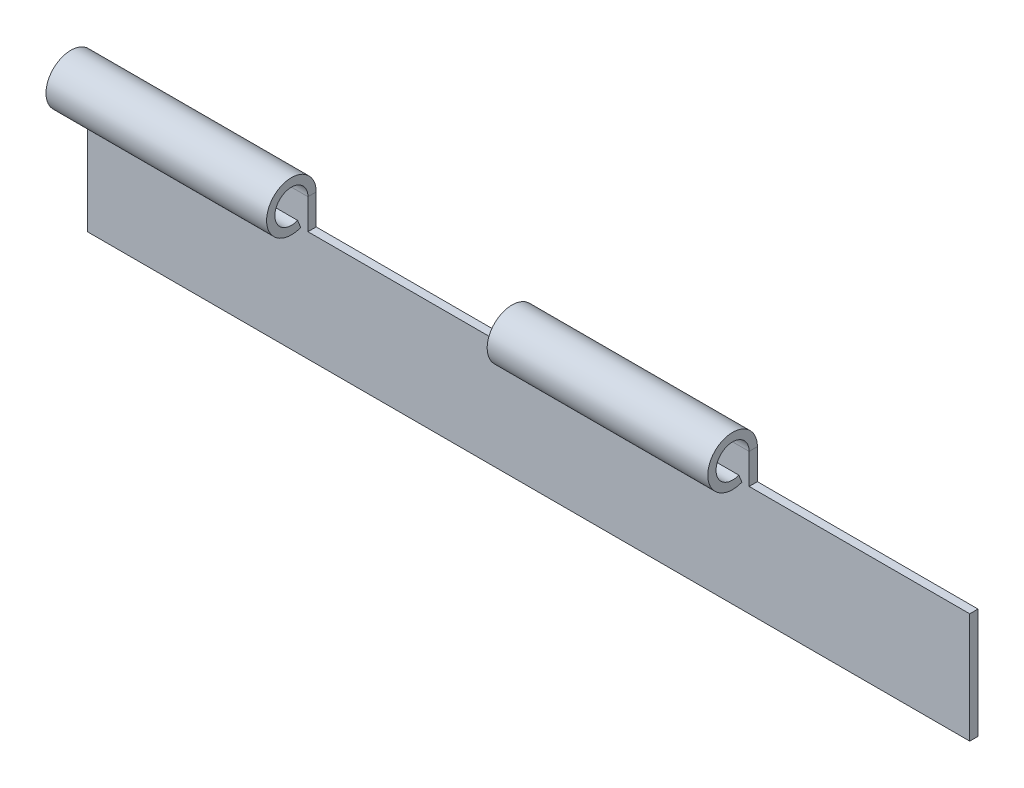
ISO-10303-21;
HEADER;
FILE_DESCRIPTION(('STEP AP214'),'2;1');
FILE_NAME('part.step','',(''),(''),'','','');
FILE_SCHEMA(('AUTOMOTIVE_DESIGN { 1 0 10303 214 1 1 1 1 }'));
ENDSEC;
DATA;
#1=APPLICATION_CONTEXT('core data for automotive mechanical design processes');
#2=APPLICATION_PROTOCOL_DEFINITION('international standard','automotive_design',2000,#1);
#3=PRODUCT_CONTEXT('',#1,'mechanical');
#4=PRODUCT('Part','Part','',(#3));
#5=PRODUCT_RELATED_PRODUCT_CATEGORY('part','',(#4));
#6=PRODUCT_DEFINITION_FORMATION('','',#4);
#7=PRODUCT_DEFINITION_CONTEXT('part definition',#1,'design');
#8=PRODUCT_DEFINITION('design','',#6,#7);
#9=PRODUCT_DEFINITION_SHAPE('','',#8);
#10=(LENGTH_UNIT() NAMED_UNIT(*) SI_UNIT(.MILLI.,.METRE.));
#11=(NAMED_UNIT(*) PLANE_ANGLE_UNIT() SI_UNIT($,.RADIAN.));
#12=(NAMED_UNIT(*) SI_UNIT($,.STERADIAN.) SOLID_ANGLE_UNIT());
#13=UNCERTAINTY_MEASURE_WITH_UNIT(LENGTH_MEASURE(1.E-05),#10,'distance_accuracy_value','');
#14=(GEOMETRIC_REPRESENTATION_CONTEXT(3) GLOBAL_UNCERTAINTY_ASSIGNED_CONTEXT((#13)) GLOBAL_UNIT_ASSIGNED_CONTEXT((#10,
#11,#12)) REPRESENTATION_CONTEXT('',''));
#15=CARTESIAN_POINT('',(0.,0.,0.));
#16=DIRECTION('',(0.,0.,1.));
#17=DIRECTION('',(1.,0.,0.));
#18=AXIS2_PLACEMENT_3D('',#15,#16,#17);
#19=CARTESIAN_POINT('',(80.,20.,-1.5));
#20=DIRECTION('',(-1.,0.,0.));
#21=DIRECTION('',(0.,0.,1.));
#22=AXIS2_PLACEMENT_3D('',#19,#20,#21);
#23=PLANE('',#22);
#24=DIRECTION('',(0.,-1.,0.));
#25=VECTOR('',#24,1.);
#26=CARTESIAN_POINT('',(80.,20.,0.));
#27=LINE('',#26,#25);
#28=CARTESIAN_POINT('',(80.,25.5,0.));
#29=VERTEX_POINT('',#28);
#30=CARTESIAN_POINT('',(80.,20.,0.));
#31=VERTEX_POINT('',#30);
#32=EDGE_CURVE('E207',#29,#31,#27,.T.);
#33=ORIENTED_EDGE('',*,*,#32,.F.);
#34=DIRECTION('',(0.,0.,-1.));
#35=VECTOR('',#34,1.);
#36=CARTESIAN_POINT('',(80.,25.5,0.));
#37=LINE('',#36,#35);
#38=CARTESIAN_POINT('',(80.,25.5,-1.5));
#39=VERTEX_POINT('',#38);
#40=EDGE_CURVE('E155',#29,#39,#37,.T.);
#41=ORIENTED_EDGE('',*,*,#40,.T.);
#42=DIRECTION('',(0.,-1.,0.));
#43=VECTOR('',#42,1.);
#44=CARTESIAN_POINT('',(80.,20.,-1.5));
#45=LINE('',#44,#43);
#46=CARTESIAN_POINT('',(80.,20.,-1.5));
#47=VERTEX_POINT('',#46);
#48=EDGE_CURVE('E175',#39,#47,#45,.T.);
#49=ORIENTED_EDGE('',*,*,#48,.T.);
#50=DIRECTION('',(0.,0.,1.));
#51=VECTOR('',#50,1.);
#52=CARTESIAN_POINT('',(80.,20.,-1.5));
#53=LINE('',#52,#51);
#54=EDGE_CURVE('E219',#47,#31,#53,.T.);
#55=ORIENTED_EDGE('',*,*,#54,.T.);
#56=EDGE_LOOP('',(#33,#41,#49,#55));
#57=FACE_BOUND('',#56,.T.);
#58=ADVANCED_FACE('F38',(#57),#23,.T.);
#59=CARTESIAN_POINT('',(0.,0.,-1.5));
#60=DIRECTION('',(-1.,0.,0.));
#61=DIRECTION('',(0.,0.,1.));
#62=AXIS2_PLACEMENT_3D('',#59,#60,#61);
#63=PLANE('',#62);
#64=DIRECTION('',(0.,-1.,0.));
#65=VECTOR('',#64,1.);
#66=CARTESIAN_POINT('',(0.,0.,0.));
#67=LINE('',#66,#65);
#68=CARTESIAN_POINT('',(0.,25.5,0.));
#69=VERTEX_POINT('',#68);
#70=CARTESIAN_POINT('',(0.,0.,0.));
#71=VERTEX_POINT('',#70);
#72=EDGE_CURVE('E215',#69,#71,#67,.T.);
#73=ORIENTED_EDGE('',*,*,#72,.F.);
#74=DIRECTION('',(0.,0.,-1.));
#75=VECTOR('',#74,1.);
#76=CARTESIAN_POINT('',(0.,25.5,0.));
#77=LINE('',#76,#75);
#78=CARTESIAN_POINT('',(0.,25.5,-1.5));
#79=VERTEX_POINT('',#78);
#80=EDGE_CURVE('E246',#69,#79,#77,.T.);
#81=ORIENTED_EDGE('',*,*,#80,.T.);
#82=DIRECTION('',(0.,-1.,0.));
#83=VECTOR('',#82,1.);
#84=CARTESIAN_POINT('',(0.,0.,-1.5));
#85=LINE('',#84,#83);
#86=CARTESIAN_POINT('',(0.,0.,-1.5));
#87=VERTEX_POINT('',#86);
#88=EDGE_CURVE('E193',#79,#87,#85,.T.);
#89=ORIENTED_EDGE('',*,*,#88,.T.);
#90=DIRECTION('',(0.,0.,1.));
#91=VECTOR('',#90,1.);
#92=CARTESIAN_POINT('',(0.,0.,-1.5));
#93=LINE('',#92,#91);
#94=EDGE_CURVE('E11',#87,#71,#93,.T.);
#95=ORIENTED_EDGE('',*,*,#94,.T.);
#96=EDGE_LOOP('',(#73,#81,#89,#95));
#97=FACE_BOUND('',#96,.T.);
#98=ADVANCED_FACE('F241',(#97),#63,.T.);
#99=CARTESIAN_POINT('',(160.,0.,-1.5));
#100=DIRECTION('',(0.,-1.,0.));
#101=DIRECTION('',(1.,0.,0.));
#102=AXIS2_PLACEMENT_3D('',#99,#100,#101);
#103=PLANE('',#102);
#104=DIRECTION('',(1.,0.,0.));
#105=VECTOR('',#104,1.);
#106=CARTESIAN_POINT('',(160.,0.,0.));
#107=LINE('',#106,#105);
#108=CARTESIAN_POINT('',(160.,0.,0.));
#109=VERTEX_POINT('',#108);
#110=EDGE_CURVE('E195',#71,#109,#107,.T.);
#111=ORIENTED_EDGE('',*,*,#110,.F.);
#112=ORIENTED_EDGE('',*,*,#94,.F.);
#113=DIRECTION('',(1.,0.,0.));
#114=VECTOR('',#113,1.);
#115=CARTESIAN_POINT('',(160.,0.,-1.5));
#116=LINE('',#115,#114);
#117=CARTESIAN_POINT('',(160.,0.,-1.5));
#118=VERTEX_POINT('',#117);
#119=EDGE_CURVE('E216',#87,#118,#116,.T.);
#120=ORIENTED_EDGE('',*,*,#119,.T.);
#121=DIRECTION('',(0.,0.,1.));
#122=VECTOR('',#121,1.);
#123=CARTESIAN_POINT('',(160.,0.,-1.5));
#124=LINE('',#123,#122);
#125=EDGE_CURVE('E42',#118,#109,#124,.T.);
#126=ORIENTED_EDGE('',*,*,#125,.T.);
#127=EDGE_LOOP('',(#111,#112,#120,#126));
#128=FACE_BOUND('',#127,.T.);
#129=ADVANCED_FACE('F40',(#128),#103,.T.);
#130=CARTESIAN_POINT('',(40.,30.,-1.5));
#131=DIRECTION('',(1.,0.,0.));
#132=DIRECTION('',(0.,0.,-1.));
#133=AXIS2_PLACEMENT_3D('',#130,#131,#132);
#134=PLANE('',#133);
#135=DIRECTION('',(0.,0.,-1.));
#136=VECTOR('',#135,1.);
#137=CARTESIAN_POINT('',(40.,25.5,0.));
#138=LINE('',#137,#136);
#139=CARTESIAN_POINT('',(40.,25.5,0.));
#140=VERTEX_POINT('',#139);
#141=CARTESIAN_POINT('',(40.,25.5,-1.5));
#142=VERTEX_POINT('',#141);
#143=EDGE_CURVE('E248',#140,#142,#138,.T.);
#144=ORIENTED_EDGE('',*,*,#143,.F.);
#145=DIRECTION('',(0.,1.,0.));
#146=VECTOR('',#145,1.);
#147=CARTESIAN_POINT('',(40.,30.,0.));
#148=LINE('',#147,#146);
#149=CARTESIAN_POINT('',(40.,20.,0.));
#150=VERTEX_POINT('',#149);
#151=EDGE_CURVE('E212',#150,#140,#148,.T.);
#152=ORIENTED_EDGE('',*,*,#151,.F.);
#153=DIRECTION('',(0.,0.,1.));
#154=VECTOR('',#153,1.);
#155=CARTESIAN_POINT('',(40.,20.,-1.5));
#156=LINE('',#155,#154);
#157=CARTESIAN_POINT('',(40.,20.,-1.5));
#158=VERTEX_POINT('',#157);
#159=EDGE_CURVE('E47',#158,#150,#156,.T.);
#160=ORIENTED_EDGE('',*,*,#159,.F.);
#161=DIRECTION('',(0.,1.,0.));
#162=VECTOR('',#161,1.);
#163=CARTESIAN_POINT('',(40.,30.,-1.5));
#164=LINE('',#163,#162);
#165=EDGE_CURVE('E190',#158,#142,#164,.T.);
#166=ORIENTED_EDGE('',*,*,#165,.T.);
#167=EDGE_LOOP('',(#144,#152,#160,#166));
#168=FACE_BOUND('',#167,.T.);
#169=ADVANCED_FACE('F297',(#168),#134,.T.);
#170=CARTESIAN_POINT('',(40.,20.,-1.5));
#171=DIRECTION('',(0.,1.,0.));
#172=DIRECTION('',(-1.,0.,0.));
#173=AXIS2_PLACEMENT_3D('',#170,#171,#172);
#174=PLANE('',#173);
#175=DIRECTION('',(-1.,0.,0.));
#176=VECTOR('',#175,1.);
#177=CARTESIAN_POINT('',(40.,20.,0.));
#178=LINE('',#177,#176);
#179=EDGE_CURVE('E209',#31,#150,#178,.T.);
#180=ORIENTED_EDGE('',*,*,#179,.F.);
#181=ORIENTED_EDGE('',*,*,#54,.F.);
#182=DIRECTION('',(-1.,0.,0.));
#183=VECTOR('',#182,1.);
#184=CARTESIAN_POINT('',(40.,20.,-1.5));
#185=LINE('',#184,#183);
#186=EDGE_CURVE('E182',#47,#158,#185,.T.);
#187=ORIENTED_EDGE('',*,*,#186,.T.);
#188=ORIENTED_EDGE('',*,*,#159,.T.);
#189=EDGE_LOOP('',(#180,#181,#187,#188));
#190=FACE_BOUND('',#189,.T.);
#191=ADVANCED_FACE('F293',(#190),#174,.T.);
#192=CARTESIAN_POINT('',(120.,30.,-1.5));
#193=DIRECTION('',(1.,0.,0.));
#194=DIRECTION('',(0.,0.,-1.));
#195=AXIS2_PLACEMENT_3D('',#192,#193,#194);
#196=PLANE('',#195);
#197=DIRECTION('',(0.,0.,-1.));
#198=VECTOR('',#197,1.);
#199=CARTESIAN_POINT('',(120.,25.5,0.));
#200=LINE('',#199,#198);
#201=CARTESIAN_POINT('',(120.,25.5,0.));
#202=VERTEX_POINT('',#201);
#203=CARTESIAN_POINT('',(120.,25.5,-1.5));
#204=VERTEX_POINT('',#203);
#205=EDGE_CURVE('E144',#202,#204,#200,.T.);
#206=ORIENTED_EDGE('',*,*,#205,.F.);
#207=DIRECTION('',(0.,1.,0.));
#208=VECTOR('',#207,1.);
#209=CARTESIAN_POINT('',(120.,30.,0.));
#210=LINE('',#209,#208);
#211=CARTESIAN_POINT('',(120.,20.,0.));
#212=VERTEX_POINT('',#211);
#213=EDGE_CURVE('E205',#212,#202,#210,.T.);
#214=ORIENTED_EDGE('',*,*,#213,.F.);
#215=DIRECTION('',(0.,0.,1.));
#216=VECTOR('',#215,1.);
#217=CARTESIAN_POINT('',(120.,20.,-1.5));
#218=LINE('',#217,#216);
#219=CARTESIAN_POINT('',(120.,20.,-1.5));
#220=VERTEX_POINT('',#219);
#221=EDGE_CURVE('E179',#220,#212,#218,.T.);
#222=ORIENTED_EDGE('',*,*,#221,.F.);
#223=DIRECTION('',(0.,1.,0.));
#224=VECTOR('',#223,1.);
#225=CARTESIAN_POINT('',(120.,30.,-1.5));
#226=LINE('',#225,#224);
#227=EDGE_CURVE('E172',#220,#204,#226,.T.);
#228=ORIENTED_EDGE('',*,*,#227,.T.);
#229=EDGE_LOOP('',(#206,#214,#222,#228));
#230=FACE_BOUND('',#229,.T.);
#231=ADVANCED_FACE('F178',(#230),#196,.T.);
#232=CARTESIAN_POINT('',(120.,20.,-1.5));
#233=DIRECTION('',(0.,1.,0.));
#234=DIRECTION('',(0.,0.,1.));
#235=AXIS2_PLACEMENT_3D('',#232,#233,#234);
#236=PLANE('',#235);
#237=DIRECTION('',(-1.,0.,0.));
#238=VECTOR('',#237,1.);
#239=CARTESIAN_POINT('',(120.,20.,0.));
#240=LINE('',#239,#238);
#241=CARTESIAN_POINT('',(160.,20.,0.));
#242=VERTEX_POINT('',#241);
#243=EDGE_CURVE('E202',#242,#212,#240,.T.);
#244=ORIENTED_EDGE('',*,*,#243,.F.);
#245=DIRECTION('',(0.,0.,1.));
#246=VECTOR('',#245,1.);
#247=CARTESIAN_POINT('',(160.,20.,-1.5));
#248=LINE('',#247,#246);
#249=CARTESIAN_POINT('',(160.,20.,-1.5));
#250=VERTEX_POINT('',#249);
#251=EDGE_CURVE('E222',#250,#242,#248,.T.);
#252=ORIENTED_EDGE('',*,*,#251,.F.);
#253=DIRECTION('',(-1.,0.,0.));
#254=VECTOR('',#253,1.);
#255=CARTESIAN_POINT('',(120.,20.,-1.5));
#256=LINE('',#255,#254);
#257=EDGE_CURVE('E180',#250,#220,#256,.T.);
#258=ORIENTED_EDGE('',*,*,#257,.T.);
#259=ORIENTED_EDGE('',*,*,#221,.T.);
#260=EDGE_LOOP('',(#244,#252,#258,#259));
#261=FACE_BOUND('',#260,.T.);
#262=ADVANCED_FACE('F332',(#261),#236,.T.);
#263=CARTESIAN_POINT('',(160.,20.,-1.5));
#264=DIRECTION('',(1.,0.,0.));
#265=DIRECTION('',(0.,0.,-1.));
#266=AXIS2_PLACEMENT_3D('',#263,#264,#265);
#267=PLANE('',#266);
#268=DIRECTION('',(0.,1.,0.));
#269=VECTOR('',#268,1.);
#270=CARTESIAN_POINT('',(160.,20.,0.));
#271=LINE('',#270,#269);
#272=EDGE_CURVE('E198',#109,#242,#271,.T.);
#273=ORIENTED_EDGE('',*,*,#272,.F.);
#274=ORIENTED_EDGE('',*,*,#125,.F.);
#275=DIRECTION('',(0.,1.,0.));
#276=VECTOR('',#275,1.);
#277=CARTESIAN_POINT('',(160.,20.,-1.5));
#278=LINE('',#277,#276);
#279=EDGE_CURVE('E184',#118,#250,#278,.T.);
#280=ORIENTED_EDGE('',*,*,#279,.T.);
#281=ORIENTED_EDGE('',*,*,#251,.T.);
#282=EDGE_LOOP('',(#273,#274,#280,#281));
#283=FACE_BOUND('',#282,.T.);
#284=ADVANCED_FACE('F233',(#283),#267,.T.);
#285=CARTESIAN_POINT('',(0.,0.,-1.5));
#286=DIRECTION('',(0.,0.,-1.));
#287=DIRECTION('',(-1.,0.,0.));
#288=AXIS2_PLACEMENT_3D('',#285,#286,#287);
#289=PLANE('',#288);
#290=DIRECTION('',(-1.,0.,0.));
#291=VECTOR('',#290,1.);
#292=CARTESIAN_POINT('',(80.,25.5,-1.5));
#293=LINE('',#292,#291);
#294=EDGE_CURVE('E162',#39,#204,#293,.F.);
#295=ORIENTED_EDGE('',*,*,#294,.T.);
#296=ORIENTED_EDGE('',*,*,#227,.F.);
#297=ORIENTED_EDGE('',*,*,#257,.F.);
#298=ORIENTED_EDGE('',*,*,#279,.F.);
#299=ORIENTED_EDGE('',*,*,#119,.F.);
#300=ORIENTED_EDGE('',*,*,#88,.F.);
#301=DIRECTION('',(-1.,0.,0.));
#302=VECTOR('',#301,1.);
#303=CARTESIAN_POINT('',(0.,25.5,-1.5));
#304=LINE('',#303,#302);
#305=EDGE_CURVE('E266',#79,#142,#304,.F.);
#306=ORIENTED_EDGE('',*,*,#305,.T.);
#307=ORIENTED_EDGE('',*,*,#165,.F.);
#308=ORIENTED_EDGE('',*,*,#186,.F.);
#309=ORIENTED_EDGE('',*,*,#48,.F.);
#310=EDGE_LOOP('',(#295,#296,#297,#298,#299,#300,#306,#307,#308,#309));
#311=FACE_BOUND('',#310,.T.);
#312=ADVANCED_FACE('F170',(#311),#289,.T.);
#313=CARTESIAN_POINT('',(0.,0.,0.));
#314=DIRECTION('',(0.,0.,-1.));
#315=DIRECTION('',(-1.,0.,0.));
#316=AXIS2_PLACEMENT_3D('',#313,#314,#315);
#317=PLANE('',#316);
#318=ORIENTED_EDGE('',*,*,#213,.T.);
#319=DIRECTION('',(-1.,0.,0.));
#320=VECTOR('',#319,1.);
#321=CARTESIAN_POINT('',(80.,25.5,0.));
#322=LINE('',#321,#320);
#323=EDGE_CURVE('E279',#29,#202,#322,.F.);
#324=ORIENTED_EDGE('',*,*,#323,.F.);
#325=ORIENTED_EDGE('',*,*,#32,.T.);
#326=ORIENTED_EDGE('',*,*,#179,.T.);
#327=ORIENTED_EDGE('',*,*,#151,.T.);
#328=DIRECTION('',(-1.,0.,0.));
#329=VECTOR('',#328,1.);
#330=CARTESIAN_POINT('',(0.,25.5,0.));
#331=LINE('',#330,#329);
#332=EDGE_CURVE('E238',#69,#140,#331,.F.);
#333=ORIENTED_EDGE('',*,*,#332,.F.);
#334=ORIENTED_EDGE('',*,*,#72,.T.);
#335=ORIENTED_EDGE('',*,*,#110,.T.);
#336=ORIENTED_EDGE('',*,*,#272,.T.);
#337=ORIENTED_EDGE('',*,*,#243,.T.);
#338=EDGE_LOOP('',(#318,#324,#325,#326,#327,#333,#334,#335,#336,#337));
#339=FACE_BOUND('',#338,.T.);
#340=ADVANCED_FACE('F235',(#339),#317,.F.);
#341=CARTESIAN_POINT('',(20.,22.7184484362996,1.87618021975223));
#342=DIRECTION('',(0.,-0.374606593415923,0.927183854566783));
#343=DIRECTION('',(-1.,0.,0.));
#344=AXIS2_PLACEMENT_3D('',#341,#342,#343);
#345=PLANE('',#344);
#346=DIRECTION('',(0.,-0.927183854566783,-0.374606593415923));
#347=VECTOR('',#346,1.);
#348=CARTESIAN_POINT('',(0.,22.7184484362996,1.87618021975223));
#349=LINE('',#348,#347);
#350=CARTESIAN_POINT('',(0.,22.7184484362996,1.87618021975223));
#351=VERTEX_POINT('',#350);
#352=CARTESIAN_POINT('',(0.,21.3276726544495,1.31427032962835));
#353=VERTEX_POINT('',#352);
#354=EDGE_CURVE('E199',#351,#353,#349,.T.);
#355=ORIENTED_EDGE('',*,*,#354,.F.);
#356=DIRECTION('',(-1.,0.,0.));
#357=VECTOR('',#356,1.);
#358=CARTESIAN_POINT('',(0.,22.7184484362996,1.87618021975223));
#359=LINE('',#358,#357);
#360=CARTESIAN_POINT('',(40.,22.7184484362996,1.87618021975223));
#361=VERTEX_POINT('',#360);
#362=EDGE_CURVE('E254',#361,#351,#359,.T.);
#363=ORIENTED_EDGE('',*,*,#362,.F.);
#364=DIRECTION('',(0.,-0.927183854566783,-0.374606593415923));
#365=VECTOR('',#364,1.);
#366=CARTESIAN_POINT('',(40.,22.7184484362996,1.87618021975223));
#367=LINE('',#366,#365);
#368=CARTESIAN_POINT('',(40.,21.3276726544495,1.31427032962835));
#369=VERTEX_POINT('',#368);
#370=EDGE_CURVE('E251',#361,#369,#367,.T.);
#371=ORIENTED_EDGE('',*,*,#370,.T.);
#372=DIRECTION('',(-1.,0.,0.));
#373=VECTOR('',#372,1.);
#374=CARTESIAN_POINT('',(0.,21.3276726544495,1.31427032962835));
#375=LINE('',#374,#373);
#376=EDGE_CURVE('E262',#369,#353,#375,.T.);
#377=ORIENTED_EDGE('',*,*,#376,.T.);
#378=EDGE_LOOP('',(#355,#363,#371,#377));
#379=FACE_BOUND('',#378,.T.);
#380=ADVANCED_FACE('F308',(#379),#345,.F.);
#381=CARTESIAN_POINT('',(40.,25.5,3.));
#382=DIRECTION('',(1.,0.,0.));
#383=DIRECTION('',(0.,0.,-1.));
#384=AXIS2_PLACEMENT_3D('',#381,#382,#383);
#385=PLANE('',#384);
#386=ORIENTED_EDGE('',*,*,#370,.F.);
#387=CARTESIAN_POINT('',(40.,25.5,3.));
#388=DIRECTION('',(-1.,0.,0.));
#389=DIRECTION('',(0.,0.,1.));
#390=AXIS2_PLACEMENT_3D('',#387,#388,#389);
#391=CIRCLE('',#390,3.);
#392=EDGE_CURVE('E259',#140,#361,#391,.F.);
#393=ORIENTED_EDGE('',*,*,#392,.F.);
#394=ORIENTED_EDGE('',*,*,#143,.T.);
#395=CARTESIAN_POINT('',(40.,25.5,3.));
#396=DIRECTION('',(-1.,0.,0.));
#397=DIRECTION('',(0.,0.,1.));
#398=AXIS2_PLACEMENT_3D('',#395,#396,#397);
#399=CIRCLE('',#398,4.5);
#400=EDGE_CURVE('E249',#142,#369,#399,.F.);
#401=ORIENTED_EDGE('',*,*,#400,.T.);
#402=EDGE_LOOP('',(#386,#393,#394,#401));
#403=FACE_BOUND('',#402,.T.);
#404=ADVANCED_FACE('F302',(#403),#385,.T.);
#405=CARTESIAN_POINT('',(0.,25.5,3.));
#406=DIRECTION('',(1.,0.,0.));
#407=DIRECTION('',(0.,0.,-1.));
#408=AXIS2_PLACEMENT_3D('',#405,#406,#407);
#409=PLANE('',#408);
#410=CARTESIAN_POINT('',(0.,25.5,3.));
#411=DIRECTION('',(-1.,0.,0.));
#412=DIRECTION('',(0.,0.,1.));
#413=AXIS2_PLACEMENT_3D('',#410,#411,#412);
#414=CIRCLE('',#413,3.);
#415=EDGE_CURVE('E63',#351,#69,#414,.T.);
#416=ORIENTED_EDGE('',*,*,#415,.F.);
#417=ORIENTED_EDGE('',*,*,#354,.T.);
#418=CARTESIAN_POINT('',(0.,25.5,3.));
#419=DIRECTION('',(-1.,0.,0.));
#420=DIRECTION('',(0.,0.,1.));
#421=AXIS2_PLACEMENT_3D('',#418,#419,#420);
#422=CIRCLE('',#421,4.5);
#423=EDGE_CURVE('E263',#353,#79,#422,.T.);
#424=ORIENTED_EDGE('',*,*,#423,.T.);
#425=ORIENTED_EDGE('',*,*,#80,.F.);
#426=EDGE_LOOP('',(#416,#417,#424,#425));
#427=FACE_BOUND('',#426,.T.);
#428=ADVANCED_FACE('F318',(#427),#409,.F.);
#429=CARTESIAN_POINT('',(0.,25.5,3.));
#430=DIRECTION('',(-1.,0.,0.));
#431=DIRECTION('',(0.,-0.927183854566783,-0.374606593415923));
#432=AXIS2_PLACEMENT_3D('',#429,#430,#431);
#433=CYLINDRICAL_SURFACE('',#432,4.5);
#434=ORIENTED_EDGE('',*,*,#305,.F.);
#435=ORIENTED_EDGE('',*,*,#423,.F.);
#436=ORIENTED_EDGE('',*,*,#376,.F.);
#437=ORIENTED_EDGE('',*,*,#400,.F.);
#438=EDGE_LOOP('',(#434,#435,#436,#437));
#439=FACE_BOUND('',#438,.T.);
#440=ADVANCED_FACE('F305',(#439),#433,.T.);
#441=CARTESIAN_POINT('',(0.,25.5,3.));
#442=DIRECTION('',(-1.,0.,0.));
#443=DIRECTION('',(0.,-0.927183854566783,-0.374606593415923));
#444=AXIS2_PLACEMENT_3D('',#441,#442,#443);
#445=CYLINDRICAL_SURFACE('',#444,3.);
#446=ORIENTED_EDGE('',*,*,#332,.T.);
#447=ORIENTED_EDGE('',*,*,#392,.T.);
#448=ORIENTED_EDGE('',*,*,#362,.T.);
#449=ORIENTED_EDGE('',*,*,#415,.T.);
#450=EDGE_LOOP('',(#446,#447,#448,#449));
#451=FACE_BOUND('',#450,.T.);
#452=ADVANCED_FACE('F310',(#451),#445,.F.);
#453=CARTESIAN_POINT('',(100.,22.7184484362996,1.87618021975223));
#454=DIRECTION('',(0.,-0.374606593415923,0.927183854566783));
#455=DIRECTION('',(-1.,0.,0.));
#456=AXIS2_PLACEMENT_3D('',#453,#454,#455);
#457=PLANE('',#456);
#458=DIRECTION('',(0.,-0.927183854566783,-0.374606593415923));
#459=VECTOR('',#458,1.);
#460=CARTESIAN_POINT('',(80.,22.7184484362996,1.87618021975223));
#461=LINE('',#460,#459);
#462=CARTESIAN_POINT('',(80.,22.7184484362996,1.87618021975223));
#463=VERTEX_POINT('',#462);
#464=CARTESIAN_POINT('',(80.,21.3276726544495,1.31427032962835));
#465=VERTEX_POINT('',#464);
#466=EDGE_CURVE('E256',#463,#465,#461,.T.);
#467=ORIENTED_EDGE('',*,*,#466,.F.);
#468=DIRECTION('',(-1.,0.,0.));
#469=VECTOR('',#468,1.);
#470=CARTESIAN_POINT('',(80.,22.7184484362996,1.87618021975223));
#471=LINE('',#470,#469);
#472=CARTESIAN_POINT('',(120.,22.7184484362996,1.87618021975223));
#473=VERTEX_POINT('',#472);
#474=EDGE_CURVE('E276',#473,#463,#471,.T.);
#475=ORIENTED_EDGE('',*,*,#474,.F.);
#476=DIRECTION('',(0.,-0.927183854566783,-0.374606593415923));
#477=VECTOR('',#476,1.);
#478=CARTESIAN_POINT('',(120.,22.7184484362996,1.87618021975223));
#479=LINE('',#478,#477);
#480=CARTESIAN_POINT('',(120.,21.3276726544495,1.31427032962835));
#481=VERTEX_POINT('',#480);
#482=EDGE_CURVE('E154',#473,#481,#479,.T.);
#483=ORIENTED_EDGE('',*,*,#482,.T.);
#484=DIRECTION('',(-1.,0.,0.));
#485=VECTOR('',#484,1.);
#486=CARTESIAN_POINT('',(80.,21.3276726544495,1.31427032962835));
#487=LINE('',#486,#485);
#488=EDGE_CURVE('E165',#481,#465,#487,.T.);
#489=ORIENTED_EDGE('',*,*,#488,.T.);
#490=EDGE_LOOP('',(#467,#475,#483,#489));
#491=FACE_BOUND('',#490,.T.);
#492=ADVANCED_FACE('F284',(#491),#457,.F.);
#493=CARTESIAN_POINT('',(120.,25.5,3.));
#494=DIRECTION('',(1.,0.,0.));
#495=DIRECTION('',(0.,0.,-1.));
#496=AXIS2_PLACEMENT_3D('',#493,#494,#495);
#497=PLANE('',#496);
#498=ORIENTED_EDGE('',*,*,#482,.F.);
#499=CARTESIAN_POINT('',(120.,25.5,3.));
#500=DIRECTION('',(-1.,0.,0.));
#501=DIRECTION('',(0.,0.,1.));
#502=AXIS2_PLACEMENT_3D('',#499,#500,#501);
#503=CIRCLE('',#502,3.);
#504=EDGE_CURVE('E149',#202,#473,#503,.F.);
#505=ORIENTED_EDGE('',*,*,#504,.F.);
#506=ORIENTED_EDGE('',*,*,#205,.T.);
#507=CARTESIAN_POINT('',(120.,25.5,3.));
#508=DIRECTION('',(-1.,0.,0.));
#509=DIRECTION('',(0.,0.,1.));
#510=AXIS2_PLACEMENT_3D('',#507,#508,#509);
#511=CIRCLE('',#510,4.5);
#512=EDGE_CURVE('E147',#204,#481,#511,.F.);
#513=ORIENTED_EDGE('',*,*,#512,.T.);
#514=EDGE_LOOP('',(#498,#505,#506,#513));
#515=FACE_BOUND('',#514,.T.);
#516=ADVANCED_FACE('F146',(#515),#497,.T.);
#517=CARTESIAN_POINT('',(80.,25.5,3.));
#518=DIRECTION('',(1.,0.,0.));
#519=DIRECTION('',(0.,0.,-1.));
#520=AXIS2_PLACEMENT_3D('',#517,#518,#519);
#521=PLANE('',#520);
#522=CARTESIAN_POINT('',(80.,25.5,3.));
#523=DIRECTION('',(-1.,0.,0.));
#524=DIRECTION('',(0.,0.,1.));
#525=AXIS2_PLACEMENT_3D('',#522,#523,#524);
#526=CIRCLE('',#525,3.);
#527=EDGE_CURVE('E55',#463,#29,#526,.T.);
#528=ORIENTED_EDGE('',*,*,#527,.F.);
#529=ORIENTED_EDGE('',*,*,#466,.T.);
#530=CARTESIAN_POINT('',(80.,25.5,3.));
#531=DIRECTION('',(-1.,0.,0.));
#532=DIRECTION('',(0.,0.,1.));
#533=AXIS2_PLACEMENT_3D('',#530,#531,#532);
#534=CIRCLE('',#533,4.5);
#535=EDGE_CURVE('E176',#465,#39,#534,.T.);
#536=ORIENTED_EDGE('',*,*,#535,.T.);
#537=ORIENTED_EDGE('',*,*,#40,.F.);
#538=EDGE_LOOP('',(#528,#529,#536,#537));
#539=FACE_BOUND('',#538,.T.);
#540=ADVANCED_FACE('F448',(#539),#521,.F.);
#541=CARTESIAN_POINT('',(80.,25.5,3.));
#542=DIRECTION('',(-1.,0.,0.));
#543=DIRECTION('',(0.,-0.927183854566783,-0.374606593415923));
#544=AXIS2_PLACEMENT_3D('',#541,#542,#543);
#545=CYLINDRICAL_SURFACE('',#544,4.5);
#546=ORIENTED_EDGE('',*,*,#294,.F.);
#547=ORIENTED_EDGE('',*,*,#535,.F.);
#548=ORIENTED_EDGE('',*,*,#488,.F.);
#549=ORIENTED_EDGE('',*,*,#512,.F.);
#550=EDGE_LOOP('',(#546,#547,#548,#549));
#551=FACE_BOUND('',#550,.T.);
#552=ADVANCED_FACE('F160',(#551),#545,.T.);
#553=CARTESIAN_POINT('',(80.,25.5,3.));
#554=DIRECTION('',(-1.,0.,0.));
#555=DIRECTION('',(0.,-0.927183854566783,-0.374606593415923));
#556=AXIS2_PLACEMENT_3D('',#553,#554,#555);
#557=CYLINDRICAL_SURFACE('',#556,3.);
#558=ORIENTED_EDGE('',*,*,#323,.T.);
#559=ORIENTED_EDGE('',*,*,#504,.T.);
#560=ORIENTED_EDGE('',*,*,#474,.T.);
#561=ORIENTED_EDGE('',*,*,#527,.T.);
#562=EDGE_LOOP('',(#558,#559,#560,#561));
#563=FACE_BOUND('',#562,.T.);
#564=ADVANCED_FACE('F286',(#563),#557,.F.);
#565=CLOSED_SHELL('',(#58,#98,#129,#169,#191,#231,#262,#284,#312,#340,#380,#404,#428,#440,#452,
#492,#516,#540,#552,#564));
#566=MANIFOLD_SOLID_BREP('B2',#565);
#567=ADVANCED_BREP_SHAPE_REPRESENTATION('',(#18,#566),#14);
#568=SHAPE_DEFINITION_REPRESENTATION(#9,#567);
ENDSEC;
END-ISO-10303-21;
